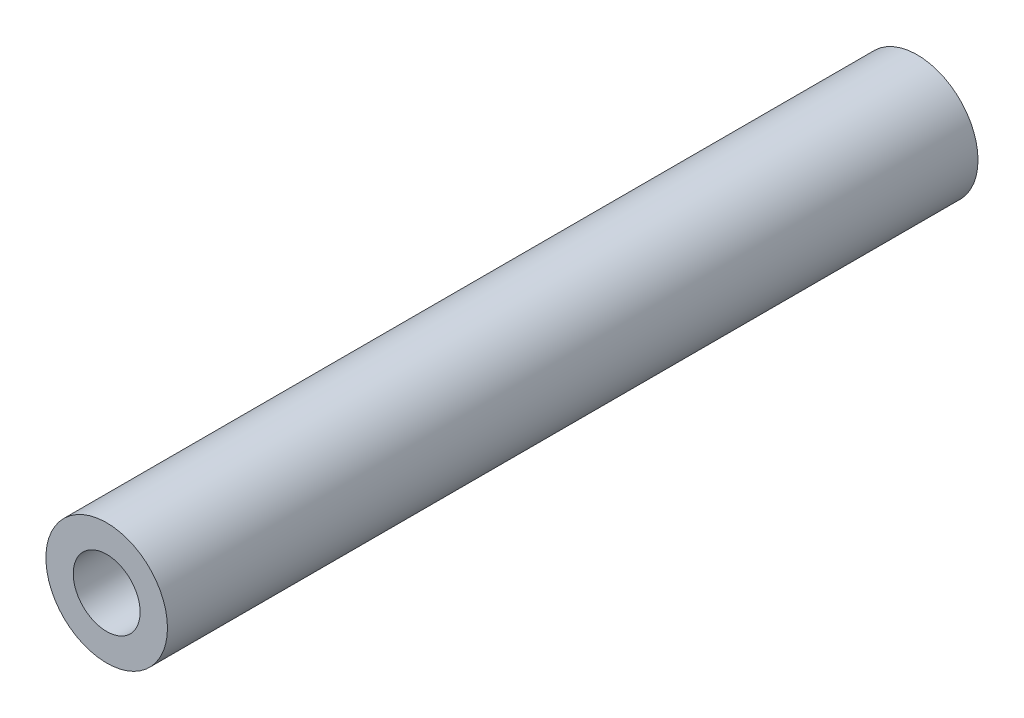
ISO-10303-21;
HEADER;
FILE_DESCRIPTION(('STEP AP214'),'2;1');
FILE_NAME('part.step','',(''),(''),'','','');
FILE_SCHEMA(('AUTOMOTIVE_DESIGN { 1 0 10303 214 1 1 1 1 }'));
ENDSEC;
DATA;
#1=APPLICATION_CONTEXT('core data for automotive mechanical design processes');
#2=APPLICATION_PROTOCOL_DEFINITION('international standard','automotive_design',2000,#1);
#3=PRODUCT_CONTEXT('',#1,'mechanical');
#4=PRODUCT('Part','Part','',(#3));
#5=PRODUCT_RELATED_PRODUCT_CATEGORY('part','',(#4));
#6=PRODUCT_DEFINITION_FORMATION('','',#4);
#7=PRODUCT_DEFINITION_CONTEXT('part definition',#1,'design');
#8=PRODUCT_DEFINITION('design','',#6,#7);
#9=PRODUCT_DEFINITION_SHAPE('','',#8);
#10=(LENGTH_UNIT() NAMED_UNIT(*) SI_UNIT(.MILLI.,.METRE.));
#11=(NAMED_UNIT(*) PLANE_ANGLE_UNIT() SI_UNIT($,.RADIAN.));
#12=(NAMED_UNIT(*) SI_UNIT($,.STERADIAN.) SOLID_ANGLE_UNIT());
#13=UNCERTAINTY_MEASURE_WITH_UNIT(LENGTH_MEASURE(1.E-05),#10,'distance_accuracy_value','');
#14=(GEOMETRIC_REPRESENTATION_CONTEXT(3) GLOBAL_UNCERTAINTY_ASSIGNED_CONTEXT((#13)) GLOBAL_UNIT_ASSIGNED_CONTEXT((#10,
#11,#12)) REPRESENTATION_CONTEXT('',''));
#15=CARTESIAN_POINT('',(0.,0.,0.));
#16=DIRECTION('',(0.,0.,1.));
#17=DIRECTION('',(1.,0.,0.));
#18=AXIS2_PLACEMENT_3D('',#15,#16,#17);
#19=CARTESIAN_POINT('',(0.,0.,40.));
#20=DIRECTION('',(0.,0.,1.));
#21=DIRECTION('',(1.,0.,0.));
#22=AXIS2_PLACEMENT_3D('',#19,#20,#21);
#23=PLANE('',#22);
#24=CARTESIAN_POINT('',(0.,0.,40.));
#25=DIRECTION('',(0.,0.,1.));
#26=DIRECTION('',(1.,0.,0.));
#27=AXIS2_PLACEMENT_3D('',#24,#25,#26);
#28=CIRCLE('',#27,3.);
#29=CARTESIAN_POINT('',(3.,0.,40.));
#30=VERTEX_POINT('',#29);
#31=EDGE_CURVE('E10',#30,#30,#28,.T.);
#32=ORIENTED_EDGE('',*,*,#31,.T.);
#33=EDGE_LOOP('',(#32));
#34=FACE_BOUND('',#33,.T.);
#35=CARTESIAN_POINT('',(0.,0.,40.));
#36=DIRECTION('',(0.,0.,1.));
#37=DIRECTION('',(1.,0.,0.));
#38=AXIS2_PLACEMENT_3D('',#35,#36,#37);
#39=CIRCLE('',#38,1.65);
#40=CARTESIAN_POINT('',(1.65,0.,40.));
#41=VERTEX_POINT('',#40);
#42=EDGE_CURVE('E43',#41,#41,#39,.T.);
#43=ORIENTED_EDGE('',*,*,#42,.F.);
#44=EDGE_LOOP('',(#43));
#45=FACE_BOUND('',#44,.T.);
#46=ADVANCED_FACE('F32',(#34,#45),#23,.T.);
#47=CARTESIAN_POINT('',(0.,0.,0.));
#48=DIRECTION('',(0.,0.,1.));
#49=DIRECTION('',(1.,0.,0.));
#50=AXIS2_PLACEMENT_3D('',#47,#48,#49);
#51=PLANE('',#50);
#52=CARTESIAN_POINT('',(0.,0.,0.));
#53=DIRECTION('',(0.,0.,1.));
#54=DIRECTION('',(1.,0.,0.));
#55=AXIS2_PLACEMENT_3D('',#52,#53,#54);
#56=CIRCLE('',#55,3.);
#57=CARTESIAN_POINT('',(3.,0.,0.));
#58=VERTEX_POINT('',#57);
#59=EDGE_CURVE('E36',#58,#58,#56,.T.);
#60=ORIENTED_EDGE('',*,*,#59,.F.);
#61=EDGE_LOOP('',(#60));
#62=FACE_BOUND('',#61,.T.);
#63=CARTESIAN_POINT('',(0.,0.,0.));
#64=DIRECTION('',(0.,0.,1.));
#65=DIRECTION('',(1.,0.,0.));
#66=AXIS2_PLACEMENT_3D('',#63,#64,#65);
#67=CIRCLE('',#66,1.65);
#68=CARTESIAN_POINT('',(1.65,0.,0.));
#69=VERTEX_POINT('',#68);
#70=EDGE_CURVE('E45',#69,#69,#67,.T.);
#71=ORIENTED_EDGE('',*,*,#70,.T.);
#72=EDGE_LOOP('',(#71));
#73=FACE_BOUND('',#72,.T.);
#74=ADVANCED_FACE('F55',(#62,#73),#51,.F.);
#75=CARTESIAN_POINT('',(0.,0.,40.));
#76=DIRECTION('',(0.,0.,-1.));
#77=DIRECTION('',(-1.,0.,0.));
#78=AXIS2_PLACEMENT_3D('',#75,#76,#77);
#79=CYLINDRICAL_SURFACE('',#78,3.);
#80=ORIENTED_EDGE('',*,*,#31,.F.);
#81=EDGE_LOOP('',(#80));
#82=FACE_BOUND('',#81,.T.);
#83=ORIENTED_EDGE('',*,*,#59,.T.);
#84=EDGE_LOOP('',(#83));
#85=FACE_BOUND('',#84,.T.);
#86=ADVANCED_FACE('F34',(#82,#85),#79,.T.);
#87=CARTESIAN_POINT('',(0.,0.,40.));
#88=DIRECTION('',(0.,0.,-1.));
#89=DIRECTION('',(-1.,0.,0.));
#90=AXIS2_PLACEMENT_3D('',#87,#88,#89);
#91=CYLINDRICAL_SURFACE('',#90,1.65);
#92=ORIENTED_EDGE('',*,*,#42,.T.);
#93=EDGE_LOOP('',(#92));
#94=FACE_BOUND('',#93,.T.);
#95=ORIENTED_EDGE('',*,*,#70,.F.);
#96=EDGE_LOOP('',(#95));
#97=FACE_BOUND('',#96,.T.);
#98=ADVANCED_FACE('F51',(#94,#97),#91,.F.);
#99=CLOSED_SHELL('',(#46,#74,#86,#98));
#100=MANIFOLD_SOLID_BREP('B2',#99);
#101=ADVANCED_BREP_SHAPE_REPRESENTATION('',(#18,#100),#14);
#102=SHAPE_DEFINITION_REPRESENTATION(#9,#101);
ENDSEC;
END-ISO-10303-21;
